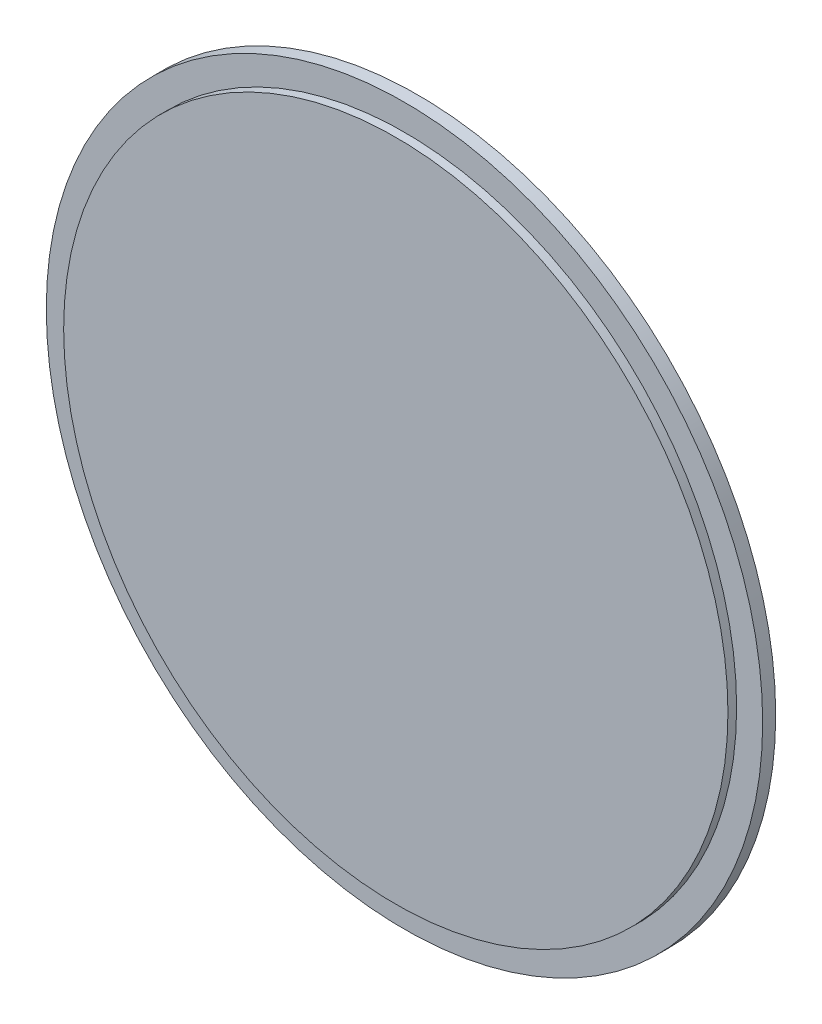
ISO-10303-21;
HEADER;
FILE_DESCRIPTION(('STEP AP214'),'2;1');
FILE_NAME('part.step','',(''),(''),'','','');
FILE_SCHEMA(('AUTOMOTIVE_DESIGN { 1 0 10303 214 1 1 1 1 }'));
ENDSEC;
DATA;
#1=APPLICATION_CONTEXT('core data for automotive mechanical design processes');
#2=APPLICATION_PROTOCOL_DEFINITION('international standard','automotive_design',2000,#1);
#3=PRODUCT_CONTEXT('',#1,'mechanical');
#4=PRODUCT('Part','Part','',(#3));
#5=PRODUCT_RELATED_PRODUCT_CATEGORY('part','',(#4));
#6=PRODUCT_DEFINITION_FORMATION('','',#4);
#7=PRODUCT_DEFINITION_CONTEXT('part definition',#1,'design');
#8=PRODUCT_DEFINITION('design','',#6,#7);
#9=PRODUCT_DEFINITION_SHAPE('','',#8);
#10=(LENGTH_UNIT() NAMED_UNIT(*) SI_UNIT(.MILLI.,.METRE.));
#11=(NAMED_UNIT(*) PLANE_ANGLE_UNIT() SI_UNIT($,.RADIAN.));
#12=(NAMED_UNIT(*) SI_UNIT($,.STERADIAN.) SOLID_ANGLE_UNIT());
#13=UNCERTAINTY_MEASURE_WITH_UNIT(LENGTH_MEASURE(1.E-05),#10,'distance_accuracy_value','');
#14=(GEOMETRIC_REPRESENTATION_CONTEXT(3) GLOBAL_UNCERTAINTY_ASSIGNED_CONTEXT((#13)) GLOBAL_UNIT_ASSIGNED_CONTEXT((#10,
#11,#12)) REPRESENTATION_CONTEXT('',''));
#15=CARTESIAN_POINT('',(0.,0.,0.));
#16=DIRECTION('',(0.,0.,1.));
#17=DIRECTION('',(1.,0.,0.));
#18=AXIS2_PLACEMENT_3D('',#15,#16,#17);
#19=CARTESIAN_POINT('',(0.,0.,3.));
#20=DIRECTION('',(0.,0.,1.));
#21=DIRECTION('',(1.,0.,0.));
#22=AXIS2_PLACEMENT_3D('',#19,#20,#21);
#23=PLANE('',#22);
#24=CARTESIAN_POINT('',(0.,0.,3.));
#25=DIRECTION('',(0.,0.,1.));
#26=DIRECTION('',(1.,0.,0.));
#27=AXIS2_PLACEMENT_3D('',#24,#25,#26);
#28=CIRCLE('',#27,76.5);
#29=CARTESIAN_POINT('',(76.5,0.,3.));
#30=VERTEX_POINT('',#29);
#31=EDGE_CURVE('E10',#30,#30,#28,.T.);
#32=ORIENTED_EDGE('',*,*,#31,.F.);
#33=EDGE_LOOP('',(#32));
#34=FACE_BOUND('',#33,.T.);
#35=CARTESIAN_POINT('',(0.,0.,3.));
#36=DIRECTION('',(0.,0.,1.));
#37=DIRECTION('',(1.,0.,0.));
#38=AXIS2_PLACEMENT_3D('',#35,#36,#37);
#39=CIRCLE('',#38,82.5);
#40=CARTESIAN_POINT('',(82.5,0.,3.));
#41=VERTEX_POINT('',#40);
#42=EDGE_CURVE('E72',#41,#41,#39,.T.);
#43=ORIENTED_EDGE('',*,*,#42,.T.);
#44=EDGE_LOOP('',(#43));
#45=FACE_BOUND('',#44,.T.);
#46=ADVANCED_FACE('F36',(#34,#45),#23,.T.);
#47=CARTESIAN_POINT('',(0.,0.,0.));
#48=DIRECTION('',(0.,0.,1.));
#49=DIRECTION('',(1.,0.,0.));
#50=AXIS2_PLACEMENT_3D('',#47,#48,#49);
#51=PLANE('',#50);
#52=CARTESIAN_POINT('',(0.,0.,0.));
#53=DIRECTION('',(0.,0.,1.));
#54=DIRECTION('',(1.,0.,0.));
#55=AXIS2_PLACEMENT_3D('',#52,#53,#54);
#56=CIRCLE('',#55,10.);
#57=CARTESIAN_POINT('',(10.,0.,0.));
#58=VERTEX_POINT('',#57);
#59=EDGE_CURVE('E40',#58,#58,#56,.T.);
#60=ORIENTED_EDGE('',*,*,#59,.T.);
#61=EDGE_LOOP('',(#60));
#62=FACE_BOUND('',#61,.T.);
#63=CARTESIAN_POINT('',(-15.120762885547,-54.9578250093568,0.));
#64=DIRECTION('',(0.,0.,1.));
#65=DIRECTION('',(1.,0.,0.));
#66=AXIS2_PLACEMENT_3D('',#63,#64,#65);
#67=CIRCLE('',#66,5.925);
#68=CARTESIAN_POINT('',(-9.19576288554697,-54.9578250093568,0.));
#69=VERTEX_POINT('',#68);
#70=EDGE_CURVE('E44',#69,#69,#67,.F.);
#71=ORIENTED_EDGE('',*,*,#70,.F.);
#72=EDGE_LOOP('',(#71));
#73=FACE_BOUND('',#72,.T.);
#74=CARTESIAN_POINT('',(-40.0344911520696,40.5738772881626,0.));
#75=DIRECTION('',(0.,0.,1.));
#76=DIRECTION('',(1.,0.,0.));
#77=AXIS2_PLACEMENT_3D('',#74,#75,#76);
#78=CIRCLE('',#77,5.925);
#79=CARTESIAN_POINT('',(-34.1094911520696,40.5738772881626,0.));
#80=VERTEX_POINT('',#79);
#81=EDGE_CURVE('E49',#80,#80,#78,.F.);
#82=ORIENTED_EDGE('',*,*,#81,.F.);
#83=EDGE_LOOP('',(#82));
#84=FACE_BOUND('',#83,.T.);
#85=CARTESIAN_POINT('',(55.1552540376161,14.3839477211941,0.));
#86=DIRECTION('',(0.,0.,1.));
#87=DIRECTION('',(1.,0.,0.));
#88=AXIS2_PLACEMENT_3D('',#85,#86,#87);
#89=CIRCLE('',#88,5.925);
#90=CARTESIAN_POINT('',(61.0802540376161,14.3839477211941,0.));
#91=VERTEX_POINT('',#90);
#92=EDGE_CURVE('E75',#91,#91,#89,.F.);
#93=ORIENTED_EDGE('',*,*,#92,.F.);
#94=EDGE_LOOP('',(#93));
#95=FACE_BOUND('',#94,.T.);
#96=CARTESIAN_POINT('',(0.,0.,0.));
#97=DIRECTION('',(0.,0.,1.));
#98=DIRECTION('',(1.,0.,0.));
#99=AXIS2_PLACEMENT_3D('',#96,#97,#98);
#100=CIRCLE('',#99,82.5);
#101=CARTESIAN_POINT('',(82.5,0.,0.));
#102=VERTEX_POINT('',#101);
#103=EDGE_CURVE('E71',#102,#102,#100,.T.);
#104=ORIENTED_EDGE('',*,*,#103,.F.);
#105=EDGE_LOOP('',(#104));
#106=FACE_BOUND('',#105,.T.);
#107=ADVANCED_FACE('F85',(#62,#73,#84,#95,#106),#51,.F.);
#108=CARTESIAN_POINT('',(0.,0.,3.));
#109=DIRECTION('',(0.,0.,-1.));
#110=DIRECTION('',(-1.,0.,0.));
#111=AXIS2_PLACEMENT_3D('',#108,#109,#110);
#112=CYLINDRICAL_SURFACE('',#111,82.5);
#113=ORIENTED_EDGE('',*,*,#42,.F.);
#114=EDGE_LOOP('',(#113));
#115=FACE_BOUND('',#114,.T.);
#116=ORIENTED_EDGE('',*,*,#103,.T.);
#117=EDGE_LOOP('',(#116));
#118=FACE_BOUND('',#117,.T.);
#119=ADVANCED_FACE('F38',(#115,#118),#112,.T.);
#120=CARTESIAN_POINT('',(55.1552540376161,14.3839477211941,-8.));
#121=DIRECTION('',(0.,0.,1.));
#122=DIRECTION('',(1.,0.,0.));
#123=AXIS2_PLACEMENT_3D('',#120,#121,#122);
#124=CYLINDRICAL_SURFACE('',#123,5.925);
#125=CARTESIAN_POINT('',(55.1552540376161,14.3839477211941,-8.));
#126=DIRECTION('',(0.,0.,-1.));
#127=DIRECTION('',(-1.,0.,0.));
#128=AXIS2_PLACEMENT_3D('',#125,#126,#127);
#129=CIRCLE('',#128,5.925);
#130=CARTESIAN_POINT('',(49.2302540376161,14.3839477211941,-8.));
#131=VERTEX_POINT('',#130);
#132=EDGE_CURVE('E68',#131,#131,#129,.T.);
#133=ORIENTED_EDGE('',*,*,#132,.F.);
#134=EDGE_LOOP('',(#133));
#135=FACE_BOUND('',#134,.T.);
#136=ORIENTED_EDGE('',*,*,#92,.T.);
#137=EDGE_LOOP('',(#136));
#138=FACE_BOUND('',#137,.T.);
#139=ADVANCED_FACE('F94',(#135,#138),#124,.T.);
#140=CARTESIAN_POINT('',(55.1552540376161,14.3839477211941,-8.));
#141=DIRECTION('',(0.,0.,-1.));
#142=DIRECTION('',(-1.,0.,0.));
#143=AXIS2_PLACEMENT_3D('',#140,#141,#142);
#144=PLANE('',#143);
#145=ORIENTED_EDGE('',*,*,#132,.T.);
#146=EDGE_LOOP('',(#145));
#147=FACE_BOUND('',#146,.T.);
#148=ADVANCED_FACE('F99',(#147),#144,.T.);
#149=CARTESIAN_POINT('',(-40.0344911520696,40.5738772881626,-8.));
#150=DIRECTION('',(0.,0.,1.));
#151=DIRECTION('',(1.,0.,0.));
#152=AXIS2_PLACEMENT_3D('',#149,#150,#151);
#153=CYLINDRICAL_SURFACE('',#152,5.925);
#154=CARTESIAN_POINT('',(-40.0344911520696,40.5738772881626,-8.));
#155=DIRECTION('',(0.,0.,-1.));
#156=DIRECTION('',(-1.,0.,0.));
#157=AXIS2_PLACEMENT_3D('',#154,#155,#156);
#158=CIRCLE('',#157,5.925);
#159=CARTESIAN_POINT('',(-45.9594911520696,40.5738772881626,-8.));
#160=VERTEX_POINT('',#159);
#161=EDGE_CURVE('E65',#160,#160,#158,.T.);
#162=ORIENTED_EDGE('',*,*,#161,.F.);
#163=EDGE_LOOP('',(#162));
#164=FACE_BOUND('',#163,.T.);
#165=ORIENTED_EDGE('',*,*,#81,.T.);
#166=EDGE_LOOP('',(#165));
#167=FACE_BOUND('',#166,.T.);
#168=ADVANCED_FACE('F83',(#164,#167),#153,.T.);
#169=CARTESIAN_POINT('',(-40.0344911520696,40.5738772881626,-8.));
#170=DIRECTION('',(0.,0.,-1.));
#171=DIRECTION('',(-1.,0.,0.));
#172=AXIS2_PLACEMENT_3D('',#169,#170,#171);
#173=PLANE('',#172);
#174=ORIENTED_EDGE('',*,*,#161,.T.);
#175=EDGE_LOOP('',(#174));
#176=FACE_BOUND('',#175,.T.);
#177=ADVANCED_FACE('F113',(#176),#173,.T.);
#178=CARTESIAN_POINT('',(-15.120762885547,-54.9578250093568,-8.));
#179=DIRECTION('',(0.,0.,1.));
#180=DIRECTION('',(1.,0.,0.));
#181=AXIS2_PLACEMENT_3D('',#178,#179,#180);
#182=CYLINDRICAL_SURFACE('',#181,5.925);
#183=CARTESIAN_POINT('',(-15.120762885547,-54.9578250093568,-8.));
#184=DIRECTION('',(0.,0.,-1.));
#185=DIRECTION('',(-1.,0.,0.));
#186=AXIS2_PLACEMENT_3D('',#183,#184,#185);
#187=CIRCLE('',#186,5.925);
#188=CARTESIAN_POINT('',(-21.045762885547,-54.9578250093568,-8.));
#189=VERTEX_POINT('',#188);
#190=EDGE_CURVE('E62',#189,#189,#187,.T.);
#191=ORIENTED_EDGE('',*,*,#190,.F.);
#192=EDGE_LOOP('',(#191));
#193=FACE_BOUND('',#192,.T.);
#194=ORIENTED_EDGE('',*,*,#70,.T.);
#195=EDGE_LOOP('',(#194));
#196=FACE_BOUND('',#195,.T.);
#197=ADVANCED_FACE('F116',(#193,#196),#182,.T.);
#198=CARTESIAN_POINT('',(-15.120762885547,-54.9578250093568,-8.));
#199=DIRECTION('',(0.,0.,-1.));
#200=DIRECTION('',(-1.,0.,0.));
#201=AXIS2_PLACEMENT_3D('',#198,#199,#200);
#202=PLANE('',#201);
#203=ORIENTED_EDGE('',*,*,#190,.T.);
#204=EDGE_LOOP('',(#203));
#205=FACE_BOUND('',#204,.T.);
#206=ADVANCED_FACE('F121',(#205),#202,.T.);
#207=CARTESIAN_POINT('',(0.,0.,-36.2842712474619));
#208=DIRECTION('',(0.,0.,1.));
#209=DIRECTION('',(1.,0.,0.));
#210=AXIS2_PLACEMENT_3D('',#207,#208,#209);
#211=CYLINDRICAL_SURFACE('',#210,10.);
#212=CARTESIAN_POINT('',(0.,0.,-8.));
#213=DIRECTION('',(0.,0.,-1.));
#214=DIRECTION('',(-1.,0.,0.));
#215=AXIS2_PLACEMENT_3D('',#212,#213,#214);
#216=CIRCLE('',#215,10.);
#217=CARTESIAN_POINT('',(-10.,0.,-8.));
#218=VERTEX_POINT('',#217);
#219=EDGE_CURVE('E56',#218,#218,#216,.F.);
#220=ORIENTED_EDGE('',*,*,#219,.T.);
#221=EDGE_LOOP('',(#220));
#222=FACE_BOUND('',#221,.T.);
#223=ORIENTED_EDGE('',*,*,#59,.F.);
#224=EDGE_LOOP('',(#223));
#225=FACE_BOUND('',#224,.T.);
#226=ADVANCED_FACE('F124',(#222,#225),#211,.T.);
#227=CARTESIAN_POINT('',(55.1552540376161,14.3839477211941,-8.));
#228=DIRECTION('',(0.,0.,-1.));
#229=DIRECTION('',(-1.,0.,0.));
#230=AXIS2_PLACEMENT_3D('',#227,#228,#229);
#231=PLANE('',#230);
#232=CARTESIAN_POINT('',(0.,0.,-8.));
#233=DIRECTION('',(0.,0.,-1.));
#234=DIRECTION('',(-1.,0.,0.));
#235=AXIS2_PLACEMENT_3D('',#232,#233,#234);
#236=CIRCLE('',#235,3.05);
#237=CARTESIAN_POINT('',(-3.05,0.,-8.));
#238=VERTEX_POINT('',#237);
#239=EDGE_CURVE('E57',#238,#238,#236,.T.);
#240=ORIENTED_EDGE('',*,*,#239,.F.);
#241=EDGE_LOOP('',(#240));
#242=FACE_BOUND('',#241,.T.);
#243=ORIENTED_EDGE('',*,*,#219,.F.);
#244=EDGE_LOOP('',(#243));
#245=FACE_BOUND('',#244,.T.);
#246=ADVANCED_FACE('F129',(#242,#245),#231,.T.);
#247=CARTESIAN_POINT('',(0.,0.,-7.));
#248=DIRECTION('',(0.,0.,-1.));
#249=DIRECTION('',(-1.,0.,0.));
#250=AXIS2_PLACEMENT_3D('',#247,#248,#249);
#251=CYLINDRICAL_SURFACE('',#250,3.05);
#252=CARTESIAN_POINT('',(0.,0.,-7.));
#253=DIRECTION('',(0.,0.,-1.));
#254=DIRECTION('',(-1.,0.,0.));
#255=AXIS2_PLACEMENT_3D('',#252,#253,#254);
#256=CIRCLE('',#255,3.05);
#257=CARTESIAN_POINT('',(-3.05,0.,-7.));
#258=VERTEX_POINT('',#257);
#259=EDGE_CURVE('E53',#258,#258,#256,.T.);
#260=ORIENTED_EDGE('',*,*,#259,.F.);
#261=EDGE_LOOP('',(#260));
#262=FACE_BOUND('',#261,.T.);
#263=ORIENTED_EDGE('',*,*,#239,.T.);
#264=EDGE_LOOP('',(#263));
#265=FACE_BOUND('',#264,.T.);
#266=ADVANCED_FACE('F132',(#262,#265),#251,.F.);
#267=CARTESIAN_POINT('',(0.,0.,-7.));
#268=DIRECTION('',(0.,0.,-1.));
#269=DIRECTION('',(-1.,0.,0.));
#270=AXIS2_PLACEMENT_3D('',#267,#268,#269);
#271=PLANE('',#270);
#272=ORIENTED_EDGE('',*,*,#259,.T.);
#273=EDGE_LOOP('',(#272));
#274=FACE_BOUND('',#273,.T.);
#275=ADVANCED_FACE('F139',(#274),#271,.T.);
#276=CARTESIAN_POINT('',(0.,0.,5.));
#277=DIRECTION('',(0.,0.,-1.));
#278=DIRECTION('',(-1.,0.,0.));
#279=AXIS2_PLACEMENT_3D('',#276,#277,#278);
#280=CYLINDRICAL_SURFACE('',#279,76.5);
#281=CARTESIAN_POINT('',(0.,0.,5.));
#282=DIRECTION('',(0.,0.,1.));
#283=DIRECTION('',(1.,0.,0.));
#284=AXIS2_PLACEMENT_3D('',#281,#282,#283);
#285=CIRCLE('',#284,76.5);
#286=CARTESIAN_POINT('',(76.5,0.,5.));
#287=VERTEX_POINT('',#286);
#288=EDGE_CURVE('E52',#287,#287,#285,.T.);
#289=ORIENTED_EDGE('',*,*,#288,.F.);
#290=EDGE_LOOP('',(#289));
#291=FACE_BOUND('',#290,.T.);
#292=ORIENTED_EDGE('',*,*,#31,.T.);
#293=EDGE_LOOP('',(#292));
#294=FACE_BOUND('',#293,.T.);
#295=ADVANCED_FACE('F143',(#291,#294),#280,.T.);
#296=CARTESIAN_POINT('',(0.,0.,5.));
#297=DIRECTION('',(0.,0.,1.));
#298=DIRECTION('',(1.,0.,0.));
#299=AXIS2_PLACEMENT_3D('',#296,#297,#298);
#300=PLANE('',#299);
#301=ORIENTED_EDGE('',*,*,#288,.T.);
#302=EDGE_LOOP('',(#301));
#303=FACE_BOUND('',#302,.T.);
#304=ADVANCED_FACE('F147',(#303),#300,.T.);
#305=CLOSED_SHELL('',(#46,#107,#119,#139,#148,#168,#177,#197,#206,#226,#246,#266,#275,#295,#304));
#306=MANIFOLD_SOLID_BREP('B2',#305);
#307=ADVANCED_BREP_SHAPE_REPRESENTATION('',(#18,#306),#14);
#308=SHAPE_DEFINITION_REPRESENTATION(#9,#307);
ENDSEC;
END-ISO-10303-21;
